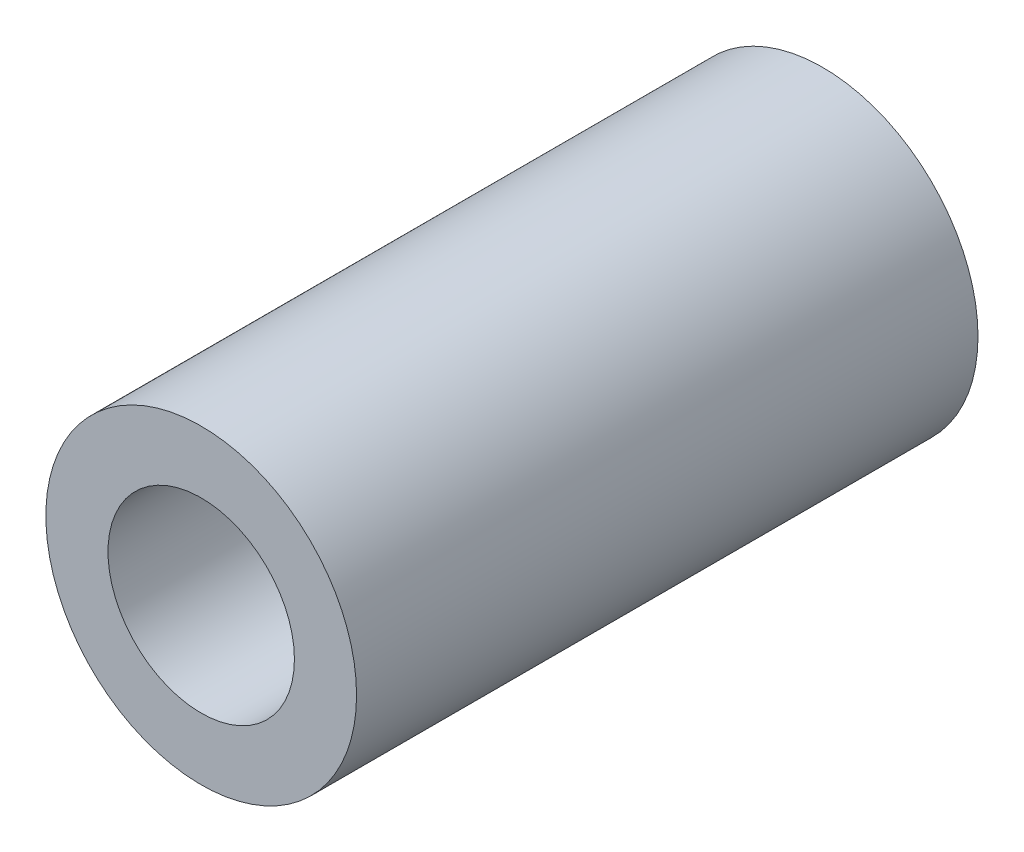
ISO-10303-21;
HEADER;
FILE_DESCRIPTION(('STEP AP214'),'2;1');
FILE_NAME('part.step','',(''),(''),'','','');
FILE_SCHEMA(('AUTOMOTIVE_DESIGN { 1 0 10303 214 1 1 1 1 }'));
ENDSEC;
DATA;
#1=APPLICATION_CONTEXT('core data for automotive mechanical design processes');
#2=APPLICATION_PROTOCOL_DEFINITION('international standard','automotive_design',2000,#1);
#3=PRODUCT_CONTEXT('',#1,'mechanical');
#4=PRODUCT('Part','Part','',(#3));
#5=PRODUCT_RELATED_PRODUCT_CATEGORY('part','',(#4));
#6=PRODUCT_DEFINITION_FORMATION('','',#4);
#7=PRODUCT_DEFINITION_CONTEXT('part definition',#1,'design');
#8=PRODUCT_DEFINITION('design','',#6,#7);
#9=PRODUCT_DEFINITION_SHAPE('','',#8);
#10=(LENGTH_UNIT() NAMED_UNIT(*) SI_UNIT(.MILLI.,.METRE.));
#11=(NAMED_UNIT(*) PLANE_ANGLE_UNIT() SI_UNIT($,.RADIAN.));
#12=(NAMED_UNIT(*) SI_UNIT($,.STERADIAN.) SOLID_ANGLE_UNIT());
#13=UNCERTAINTY_MEASURE_WITH_UNIT(LENGTH_MEASURE(1.E-05),#10,'distance_accuracy_value','');
#14=(GEOMETRIC_REPRESENTATION_CONTEXT(3) GLOBAL_UNCERTAINTY_ASSIGNED_CONTEXT((#13)) GLOBAL_UNIT_ASSIGNED_CONTEXT((#10,
#11,#12)) REPRESENTATION_CONTEXT('',''));
#15=CARTESIAN_POINT('',(0.,0.,0.));
#16=DIRECTION('',(0.,0.,1.));
#17=DIRECTION('',(1.,0.,0.));
#18=AXIS2_PLACEMENT_3D('',#15,#16,#17);
#19=CARTESIAN_POINT('',(0.,0.,5.));
#20=DIRECTION('',(0.,0.,1.));
#21=DIRECTION('',(1.,0.,0.));
#22=AXIS2_PLACEMENT_3D('',#19,#20,#21);
#23=PLANE('',#22);
#24=CARTESIAN_POINT('',(0.,0.,5.));
#25=DIRECTION('',(0.,0.,1.));
#26=DIRECTION('',(1.,0.,0.));
#27=AXIS2_PLACEMENT_3D('',#24,#25,#26);
#28=CIRCLE('',#27,2.5);
#29=CARTESIAN_POINT('',(2.5,0.,5.));
#30=VERTEX_POINT('',#29);
#31=EDGE_CURVE('E10',#30,#30,#28,.T.);
#32=ORIENTED_EDGE('',*,*,#31,.T.);
#33=EDGE_LOOP('',(#32));
#34=FACE_BOUND('',#33,.T.);
#35=CARTESIAN_POINT('',(0.,0.,5.));
#36=DIRECTION('',(0.,0.,1.));
#37=DIRECTION('',(1.,0.,0.));
#38=AXIS2_PLACEMENT_3D('',#35,#36,#37);
#39=CIRCLE('',#38,1.5);
#40=CARTESIAN_POINT('',(1.5,0.,5.));
#41=VERTEX_POINT('',#40);
#42=EDGE_CURVE('E41',#41,#41,#39,.T.);
#43=ORIENTED_EDGE('',*,*,#42,.F.);
#44=EDGE_LOOP('',(#43));
#45=FACE_BOUND('',#44,.T.);
#46=ADVANCED_FACE('F30',(#34,#45),#23,.T.);
#47=CARTESIAN_POINT('',(0.,0.,-5.));
#48=DIRECTION('',(0.,0.,1.));
#49=DIRECTION('',(1.,0.,0.));
#50=AXIS2_PLACEMENT_3D('',#47,#48,#49);
#51=PLANE('',#50);
#52=CARTESIAN_POINT('',(0.,0.,-5.));
#53=DIRECTION('',(0.,0.,1.));
#54=DIRECTION('',(1.,0.,0.));
#55=AXIS2_PLACEMENT_3D('',#52,#53,#54);
#56=CIRCLE('',#55,2.5);
#57=CARTESIAN_POINT('',(2.5,0.,-5.));
#58=VERTEX_POINT('',#57);
#59=EDGE_CURVE('E34',#58,#58,#56,.T.);
#60=ORIENTED_EDGE('',*,*,#59,.F.);
#61=EDGE_LOOP('',(#60));
#62=FACE_BOUND('',#61,.T.);
#63=CARTESIAN_POINT('',(0.,0.,-5.));
#64=DIRECTION('',(0.,0.,1.));
#65=DIRECTION('',(1.,0.,0.));
#66=AXIS2_PLACEMENT_3D('',#63,#64,#65);
#67=CIRCLE('',#66,1.5);
#68=CARTESIAN_POINT('',(1.5,0.,-5.));
#69=VERTEX_POINT('',#68);
#70=EDGE_CURVE('E43',#69,#69,#67,.T.);
#71=ORIENTED_EDGE('',*,*,#70,.T.);
#72=EDGE_LOOP('',(#71));
#73=FACE_BOUND('',#72,.T.);
#74=ADVANCED_FACE('F53',(#62,#73),#51,.F.);
#75=CARTESIAN_POINT('',(0.,0.,5.));
#76=DIRECTION('',(0.,0.,-1.));
#77=DIRECTION('',(-1.,0.,0.));
#78=AXIS2_PLACEMENT_3D('',#75,#76,#77);
#79=CYLINDRICAL_SURFACE('',#78,2.5);
#80=ORIENTED_EDGE('',*,*,#31,.F.);
#81=EDGE_LOOP('',(#80));
#82=FACE_BOUND('',#81,.T.);
#83=ORIENTED_EDGE('',*,*,#59,.T.);
#84=EDGE_LOOP('',(#83));
#85=FACE_BOUND('',#84,.T.);
#86=ADVANCED_FACE('F32',(#82,#85),#79,.T.);
#87=CARTESIAN_POINT('',(0.,0.,5.));
#88=DIRECTION('',(0.,0.,-1.));
#89=DIRECTION('',(-1.,0.,0.));
#90=AXIS2_PLACEMENT_3D('',#87,#88,#89);
#91=CYLINDRICAL_SURFACE('',#90,1.5);
#92=ORIENTED_EDGE('',*,*,#42,.T.);
#93=EDGE_LOOP('',(#92));
#94=FACE_BOUND('',#93,.T.);
#95=ORIENTED_EDGE('',*,*,#70,.F.);
#96=EDGE_LOOP('',(#95));
#97=FACE_BOUND('',#96,.T.);
#98=ADVANCED_FACE('F49',(#94,#97),#91,.F.);
#99=CLOSED_SHELL('',(#46,#74,#86,#98));
#100=MANIFOLD_SOLID_BREP('B2',#99);
#101=ADVANCED_BREP_SHAPE_REPRESENTATION('',(#18,#100),#14);
#102=SHAPE_DEFINITION_REPRESENTATION(#9,#101);
ENDSEC;
END-ISO-10303-21;
